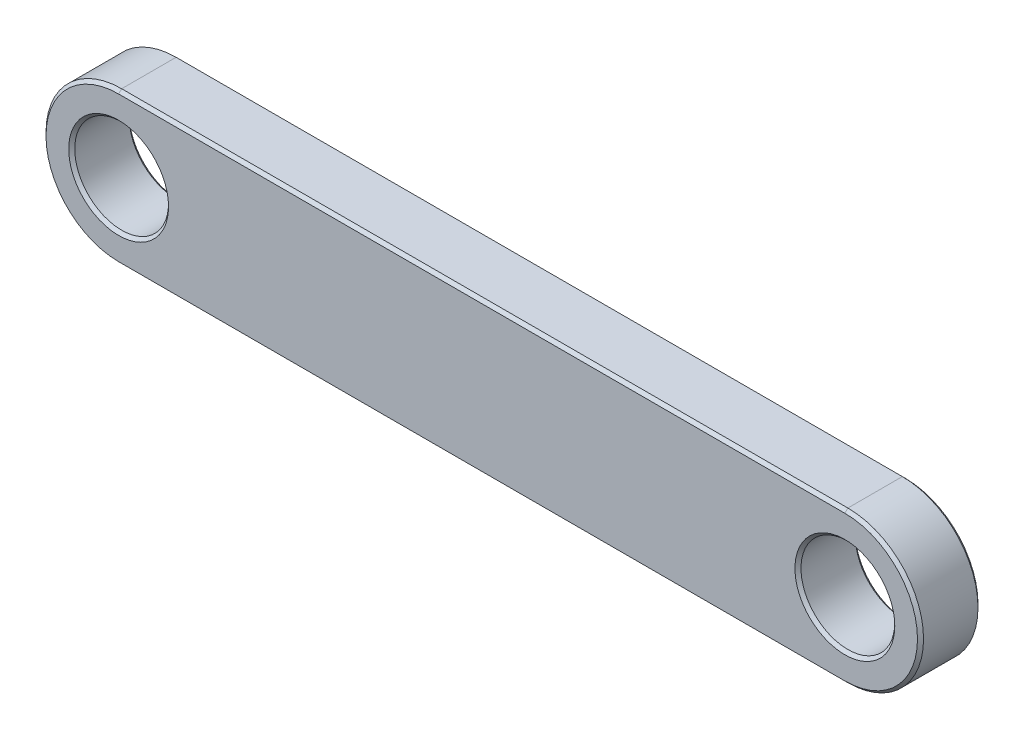
ISO-10303-21;
HEADER;
FILE_DESCRIPTION(('STEP AP214'),'2;1');
FILE_NAME('part.step','',(''),(''),'','','');
FILE_SCHEMA(('AUTOMOTIVE_DESIGN { 1 0 10303 214 1 1 1 1 }'));
ENDSEC;
DATA;
#1=APPLICATION_CONTEXT('core data for automotive mechanical design processes');
#2=APPLICATION_PROTOCOL_DEFINITION('international standard','automotive_design',2000,#1);
#3=PRODUCT_CONTEXT('',#1,'mechanical');
#4=PRODUCT('Part','Part','',(#3));
#5=PRODUCT_RELATED_PRODUCT_CATEGORY('part','',(#4));
#6=PRODUCT_DEFINITION_FORMATION('','',#4);
#7=PRODUCT_DEFINITION_CONTEXT('part definition',#1,'design');
#8=PRODUCT_DEFINITION('design','',#6,#7);
#9=PRODUCT_DEFINITION_SHAPE('','',#8);
#10=(LENGTH_UNIT() NAMED_UNIT(*) SI_UNIT(.MILLI.,.METRE.));
#11=(NAMED_UNIT(*) PLANE_ANGLE_UNIT() SI_UNIT($,.RADIAN.));
#12=(NAMED_UNIT(*) SI_UNIT($,.STERADIAN.) SOLID_ANGLE_UNIT());
#13=UNCERTAINTY_MEASURE_WITH_UNIT(LENGTH_MEASURE(1.E-05),#10,'distance_accuracy_value','');
#14=(GEOMETRIC_REPRESENTATION_CONTEXT(3) GLOBAL_UNCERTAINTY_ASSIGNED_CONTEXT((#13)) GLOBAL_UNIT_ASSIGNED_CONTEXT((#10,
#11,#12)) REPRESENTATION_CONTEXT('',''));
#15=CARTESIAN_POINT('',(0.,0.,0.));
#16=DIRECTION('',(0.,0.,1.));
#17=DIRECTION('',(1.,0.,0.));
#18=AXIS2_PLACEMENT_3D('',#15,#16,#17);
#19=CARTESIAN_POINT('',(-12.,0.,2.));
#20=DIRECTION('',(0.,0.,-1.));
#21=DIRECTION('',(-1.,0.,0.));
#22=AXIS2_PLACEMENT_3D('',#19,#20,#21);
#23=CYLINDRICAL_SURFACE('',#22,2.5);
#24=DIRECTION('',(0.,0.,-1.));
#25=VECTOR('',#24,1.);
#26=CARTESIAN_POINT('',(-12.,-2.5,2.));
#27=LINE('',#26,#25);
#28=CARTESIAN_POINT('',(-12.,-2.5,1.9));
#29=VERTEX_POINT('',#28);
#30=CARTESIAN_POINT('',(-12.,-2.5,0.0999999999999959));
#31=VERTEX_POINT('',#30);
#32=EDGE_CURVE('E241',#29,#31,#27,.T.);
#33=ORIENTED_EDGE('',*,*,#32,.F.);
#34=CARTESIAN_POINT('',(-12.,0.,1.9));
#35=DIRECTION('',(0.,0.,1.));
#36=DIRECTION('',(1.,0.,0.));
#37=AXIS2_PLACEMENT_3D('',#34,#35,#36);
#38=CIRCLE('',#37,2.5);
#39=CARTESIAN_POINT('',(-12.,2.5,1.9));
#40=VERTEX_POINT('',#39);
#41=EDGE_CURVE('E212',#29,#40,#38,.F.);
#42=ORIENTED_EDGE('',*,*,#41,.T.);
#43=DIRECTION('',(0.,0.,-1.));
#44=VECTOR('',#43,1.);
#45=CARTESIAN_POINT('',(-12.,2.5,2.));
#46=LINE('',#45,#44);
#47=CARTESIAN_POINT('',(-12.,2.5,0.0999999999999959));
#48=VERTEX_POINT('',#47);
#49=EDGE_CURVE('E150',#40,#48,#46,.T.);
#50=ORIENTED_EDGE('',*,*,#49,.T.);
#51=CARTESIAN_POINT('',(-12.,0.,0.0999999999999959));
#52=DIRECTION('',(0.,0.,1.));
#53=DIRECTION('',(1.,0.,0.));
#54=AXIS2_PLACEMENT_3D('',#51,#52,#53);
#55=CIRCLE('',#54,2.5);
#56=EDGE_CURVE('E215',#48,#31,#55,.T.);
#57=ORIENTED_EDGE('',*,*,#56,.T.);
#58=EDGE_LOOP('',(#33,#42,#50,#57));
#59=FACE_BOUND('',#58,.T.);
#60=ADVANCED_FACE('F46',(#59),#23,.T.);
#61=CARTESIAN_POINT('',(-12.,-2.5,2.));
#62=DIRECTION('',(0.,1.,0.));
#63=DIRECTION('',(-1.,0.,0.));
#64=AXIS2_PLACEMENT_3D('',#61,#62,#63);
#65=PLANE('',#64);
#66=DIRECTION('',(0.,0.,-1.));
#67=VECTOR('',#66,1.);
#68=CARTESIAN_POINT('',(12.,-2.5,2.));
#69=LINE('',#68,#67);
#70=CARTESIAN_POINT('',(12.,-2.5,1.9));
#71=VERTEX_POINT('',#70);
#72=CARTESIAN_POINT('',(12.,-2.5,0.0999999999999959));
#73=VERTEX_POINT('',#72);
#74=EDGE_CURVE('E245',#71,#73,#69,.T.);
#75=ORIENTED_EDGE('',*,*,#74,.F.);
#76=DIRECTION('',(-1.,0.,0.));
#77=VECTOR('',#76,1.);
#78=CARTESIAN_POINT('',(-12.,-2.5,1.9));
#79=LINE('',#78,#77);
#80=EDGE_CURVE('E223',#71,#29,#79,.T.);
#81=ORIENTED_EDGE('',*,*,#80,.T.);
#82=ORIENTED_EDGE('',*,*,#32,.T.);
#83=DIRECTION('',(1.,0.,0.));
#84=VECTOR('',#83,1.);
#85=CARTESIAN_POINT('',(-12.,-2.5,0.0999999999999959));
#86=LINE('',#85,#84);
#87=EDGE_CURVE('E227',#31,#73,#86,.T.);
#88=ORIENTED_EDGE('',*,*,#87,.T.);
#89=EDGE_LOOP('',(#75,#81,#82,#88));
#90=FACE_BOUND('',#89,.T.);
#91=ADVANCED_FACE('F280',(#90),#65,.F.);
#92=CARTESIAN_POINT('',(12.,0.,2.));
#93=DIRECTION('',(0.,0.,-1.));
#94=DIRECTION('',(-1.,0.,0.));
#95=AXIS2_PLACEMENT_3D('',#92,#93,#94);
#96=CYLINDRICAL_SURFACE('',#95,2.5);
#97=DIRECTION('',(0.,0.,-1.));
#98=VECTOR('',#97,1.);
#99=CARTESIAN_POINT('',(12.,2.50000000000001,2.));
#100=LINE('',#99,#98);
#101=CARTESIAN_POINT('',(12.,2.50000000000001,1.9));
#102=VERTEX_POINT('',#101);
#103=CARTESIAN_POINT('',(12.,2.50000000000001,0.0999999999999959));
#104=VERTEX_POINT('',#103);
#105=EDGE_CURVE('E249',#102,#104,#100,.T.);
#106=ORIENTED_EDGE('',*,*,#105,.F.);
#107=CARTESIAN_POINT('',(12.,0.,1.9));
#108=DIRECTION('',(0.,0.,1.));
#109=DIRECTION('',(1.,0.,0.));
#110=AXIS2_PLACEMENT_3D('',#107,#108,#109);
#111=CIRCLE('',#110,2.5);
#112=EDGE_CURVE('E144',#102,#71,#111,.F.);
#113=ORIENTED_EDGE('',*,*,#112,.T.);
#114=ORIENTED_EDGE('',*,*,#74,.T.);
#115=CARTESIAN_POINT('',(12.,0.,0.0999999999999959));
#116=DIRECTION('',(0.,0.,1.));
#117=DIRECTION('',(1.,0.,0.));
#118=AXIS2_PLACEMENT_3D('',#115,#116,#117);
#119=CIRCLE('',#118,2.5);
#120=EDGE_CURVE('E220',#73,#104,#119,.T.);
#121=ORIENTED_EDGE('',*,*,#120,.T.);
#122=EDGE_LOOP('',(#106,#113,#114,#121));
#123=FACE_BOUND('',#122,.T.);
#124=ADVANCED_FACE('F284',(#123),#96,.T.);
#125=CARTESIAN_POINT('',(-12.,2.5,2.));
#126=DIRECTION('',(0.,-1.,0.));
#127=DIRECTION('',(1.,0.,0.));
#128=AXIS2_PLACEMENT_3D('',#125,#126,#127);
#129=PLANE('',#128);
#130=ORIENTED_EDGE('',*,*,#49,.F.);
#131=DIRECTION('',(1.,0.,0.));
#132=VECTOR('',#131,1.);
#133=CARTESIAN_POINT('',(12.,2.50000000000001,1.9));
#134=LINE('',#133,#132);
#135=EDGE_CURVE('E205',#40,#102,#134,.T.);
#136=ORIENTED_EDGE('',*,*,#135,.T.);
#137=ORIENTED_EDGE('',*,*,#105,.T.);
#138=DIRECTION('',(-1.,0.,0.));
#139=VECTOR('',#138,1.);
#140=CARTESIAN_POINT('',(-12.,2.5,0.0999999999999959));
#141=LINE('',#140,#139);
#142=EDGE_CURVE('E208',#104,#48,#141,.T.);
#143=ORIENTED_EDGE('',*,*,#142,.T.);
#144=EDGE_LOOP('',(#130,#136,#137,#143));
#145=FACE_BOUND('',#144,.T.);
#146=ADVANCED_FACE('F260',(#145),#129,.F.);
#147=CARTESIAN_POINT('',(-12.,0.,2.));
#148=DIRECTION('',(0.,0.,1.));
#149=DIRECTION('',(1.,0.,0.));
#150=AXIS2_PLACEMENT_3D('',#147,#148,#149);
#151=PLANE('',#150);
#152=CARTESIAN_POINT('',(-12.,0.,2.));
#153=DIRECTION('',(0.,0.,1.));
#154=DIRECTION('',(1.,0.,0.));
#155=AXIS2_PLACEMENT_3D('',#152,#153,#154);
#156=CIRCLE('',#155,2.4);
#157=CARTESIAN_POINT('',(-12.,2.4,2.));
#158=VERTEX_POINT('',#157);
#159=CARTESIAN_POINT('',(-12.,-2.4,2.));
#160=VERTEX_POINT('',#159);
#161=EDGE_CURVE('E129',#158,#160,#156,.T.);
#162=ORIENTED_EDGE('',*,*,#161,.T.);
#163=DIRECTION('',(1.,0.,0.));
#164=VECTOR('',#163,1.);
#165=CARTESIAN_POINT('',(12.,-2.4,2.));
#166=LINE('',#165,#164);
#167=CARTESIAN_POINT('',(12.,-2.4,2.));
#168=VERTEX_POINT('',#167);
#169=EDGE_CURVE('E124',#160,#168,#166,.T.);
#170=ORIENTED_EDGE('',*,*,#169,.T.);
#171=CARTESIAN_POINT('',(12.,0.,2.));
#172=DIRECTION('',(0.,0.,1.));
#173=DIRECTION('',(1.,0.,0.));
#174=AXIS2_PLACEMENT_3D('',#171,#172,#173);
#175=CIRCLE('',#174,2.4);
#176=CARTESIAN_POINT('',(12.,2.40000000000001,2.));
#177=VERTEX_POINT('',#176);
#178=EDGE_CURVE('E117',#168,#177,#175,.T.);
#179=ORIENTED_EDGE('',*,*,#178,.T.);
#180=DIRECTION('',(-1.,0.,0.));
#181=VECTOR('',#180,1.);
#182=CARTESIAN_POINT('',(-12.,2.4,2.));
#183=LINE('',#182,#181);
#184=EDGE_CURVE('E121',#177,#158,#183,.T.);
#185=ORIENTED_EDGE('',*,*,#184,.T.);
#186=EDGE_LOOP('',(#162,#170,#179,#185));
#187=FACE_BOUND('',#186,.T.);
#188=CARTESIAN_POINT('',(12.,0.,2.));
#189=DIRECTION('',(0.,0.,1.));
#190=DIRECTION('',(1.,0.,0.));
#191=AXIS2_PLACEMENT_3D('',#188,#189,#190);
#192=CIRCLE('',#191,1.65000000000001);
#193=CARTESIAN_POINT('',(13.65,0.,2.));
#194=VERTEX_POINT('',#193);
#195=EDGE_CURVE('E141',#194,#194,#192,.F.);
#196=ORIENTED_EDGE('',*,*,#195,.T.);
#197=EDGE_LOOP('',(#196));
#198=FACE_BOUND('',#197,.T.);
#199=CARTESIAN_POINT('',(-12.,0.,2.));
#200=DIRECTION('',(0.,0.,1.));
#201=DIRECTION('',(1.,0.,0.));
#202=AXIS2_PLACEMENT_3D('',#199,#200,#201);
#203=CIRCLE('',#202,1.65000000000001);
#204=CARTESIAN_POINT('',(-10.35,0.,2.));
#205=VERTEX_POINT('',#204);
#206=EDGE_CURVE('E237',#205,#205,#203,.F.);
#207=ORIENTED_EDGE('',*,*,#206,.T.);
#208=EDGE_LOOP('',(#207));
#209=FACE_BOUND('',#208,.T.);
#210=ADVANCED_FACE('F119',(#187,#198,#209),#151,.T.);
#211=CARTESIAN_POINT('',(-12.,0.,0.));
#212=DIRECTION('',(0.,0.,1.));
#213=DIRECTION('',(1.,0.,0.));
#214=AXIS2_PLACEMENT_3D('',#211,#212,#213);
#215=PLANE('',#214);
#216=CARTESIAN_POINT('',(-12.,0.,0.));
#217=DIRECTION('',(0.,0.,1.));
#218=DIRECTION('',(1.,0.,0.));
#219=AXIS2_PLACEMENT_3D('',#216,#217,#218);
#220=CIRCLE('',#219,2.4);
#221=CARTESIAN_POINT('',(-12.,-2.4,0.));
#222=VERTEX_POINT('',#221);
#223=CARTESIAN_POINT('',(-12.,2.4,0.));
#224=VERTEX_POINT('',#223);
#225=EDGE_CURVE('E65',#222,#224,#220,.F.);
#226=ORIENTED_EDGE('',*,*,#225,.T.);
#227=DIRECTION('',(1.,0.,0.));
#228=VECTOR('',#227,1.);
#229=CARTESIAN_POINT('',(-12.,2.4,0.));
#230=LINE('',#229,#228);
#231=CARTESIAN_POINT('',(12.,2.4,0.));
#232=VERTEX_POINT('',#231);
#233=EDGE_CURVE('E186',#224,#232,#230,.T.);
#234=ORIENTED_EDGE('',*,*,#233,.T.);
#235=CARTESIAN_POINT('',(12.,0.,0.));
#236=DIRECTION('',(0.,0.,1.));
#237=DIRECTION('',(1.,0.,0.));
#238=AXIS2_PLACEMENT_3D('',#235,#236,#237);
#239=CIRCLE('',#238,2.4);
#240=CARTESIAN_POINT('',(12.,-2.4,0.));
#241=VERTEX_POINT('',#240);
#242=EDGE_CURVE('E191',#232,#241,#239,.F.);
#243=ORIENTED_EDGE('',*,*,#242,.T.);
#244=DIRECTION('',(-1.,0.,0.));
#245=VECTOR('',#244,1.);
#246=CARTESIAN_POINT('',(-12.,-2.4,0.));
#247=LINE('',#246,#245);
#248=EDGE_CURVE('E194',#241,#222,#247,.T.);
#249=ORIENTED_EDGE('',*,*,#248,.T.);
#250=EDGE_LOOP('',(#226,#234,#243,#249));
#251=FACE_BOUND('',#250,.T.);
#252=CARTESIAN_POINT('',(12.,0.,0.));
#253=DIRECTION('',(0.,0.,1.));
#254=DIRECTION('',(1.,0.,0.));
#255=AXIS2_PLACEMENT_3D('',#252,#253,#254);
#256=CIRCLE('',#255,1.65000000000001);
#257=CARTESIAN_POINT('',(13.65,0.,0.));
#258=VERTEX_POINT('',#257);
#259=EDGE_CURVE('E197',#258,#258,#256,.T.);
#260=ORIENTED_EDGE('',*,*,#259,.T.);
#261=EDGE_LOOP('',(#260));
#262=FACE_BOUND('',#261,.T.);
#263=CARTESIAN_POINT('',(-12.,0.,0.));
#264=DIRECTION('',(0.,0.,1.));
#265=DIRECTION('',(1.,0.,0.));
#266=AXIS2_PLACEMENT_3D('',#263,#264,#265);
#267=CIRCLE('',#266,1.65);
#268=CARTESIAN_POINT('',(-10.35,0.,0.));
#269=VERTEX_POINT('',#268);
#270=EDGE_CURVE('E201',#269,#269,#267,.T.);
#271=ORIENTED_EDGE('',*,*,#270,.T.);
#272=EDGE_LOOP('',(#271));
#273=FACE_BOUND('',#272,.T.);
#274=ADVANCED_FACE('F293',(#251,#262,#273),#215,.F.);
#275=CARTESIAN_POINT('',(12.,0.,0.));
#276=DIRECTION('',(0.,0.,1.));
#277=DIRECTION('',(1.,0.,0.));
#278=AXIS2_PLACEMENT_3D('',#275,#276,#277);
#279=CYLINDRICAL_SURFACE('',#278,1.55);
#280=CARTESIAN_POINT('',(12.,0.,0.100000000000005));
#281=DIRECTION('',(0.,0.,1.));
#282=DIRECTION('',(1.,0.,0.));
#283=AXIS2_PLACEMENT_3D('',#280,#281,#282);
#284=CIRCLE('',#283,1.55);
#285=CARTESIAN_POINT('',(13.55,0.,0.100000000000005));
#286=VERTEX_POINT('',#285);
#287=EDGE_CURVE('E178',#286,#286,#284,.F.);
#288=ORIENTED_EDGE('',*,*,#287,.T.);
#289=EDGE_LOOP('',(#288));
#290=FACE_BOUND('',#289,.T.);
#291=CARTESIAN_POINT('',(12.,0.,1.89999999999999));
#292=DIRECTION('',(0.,0.,1.));
#293=DIRECTION('',(1.,0.,0.));
#294=AXIS2_PLACEMENT_3D('',#291,#292,#293);
#295=CIRCLE('',#294,1.55);
#296=CARTESIAN_POINT('',(13.55,0.,1.89999999999999));
#297=VERTEX_POINT('',#296);
#298=EDGE_CURVE('E182',#297,#297,#295,.T.);
#299=ORIENTED_EDGE('',*,*,#298,.T.);
#300=EDGE_LOOP('',(#299));
#301=FACE_BOUND('',#300,.T.);
#302=ADVANCED_FACE('F296',(#290,#301),#279,.F.);
#303=CARTESIAN_POINT('',(-12.,0.,0.));
#304=DIRECTION('',(0.,0.,1.));
#305=DIRECTION('',(1.,0.,0.));
#306=AXIS2_PLACEMENT_3D('',#303,#304,#305);
#307=CYLINDRICAL_SURFACE('',#306,1.55);
#308=CARTESIAN_POINT('',(-12.,0.,0.100000000000001));
#309=DIRECTION('',(0.,0.,1.));
#310=DIRECTION('',(1.,0.,0.));
#311=AXIS2_PLACEMENT_3D('',#308,#309,#310);
#312=CIRCLE('',#311,1.55);
#313=CARTESIAN_POINT('',(-10.45,0.,0.100000000000001));
#314=VERTEX_POINT('',#313);
#315=EDGE_CURVE('E11',#314,#314,#312,.F.);
#316=ORIENTED_EDGE('',*,*,#315,.T.);
#317=EDGE_LOOP('',(#316));
#318=FACE_BOUND('',#317,.T.);
#319=CARTESIAN_POINT('',(-12.,0.,1.89999999999999));
#320=DIRECTION('',(0.,0.,1.));
#321=DIRECTION('',(1.,0.,0.));
#322=AXIS2_PLACEMENT_3D('',#319,#320,#321);
#323=CIRCLE('',#322,1.55);
#324=CARTESIAN_POINT('',(-10.45,0.,1.89999999999999));
#325=VERTEX_POINT('',#324);
#326=EDGE_CURVE('E57',#325,#325,#323,.T.);
#327=ORIENTED_EDGE('',*,*,#326,.T.);
#328=EDGE_LOOP('',(#327));
#329=FACE_BOUND('',#328,.T.);
#330=ADVANCED_FACE('F301',(#318,#329),#307,.F.);
#331=CARTESIAN_POINT('',(-12.,2.4,2.));
#332=DIRECTION('',(0.,0.70710678118656,0.707106781186535));
#333=DIRECTION('',(1.,0.,0.));
#334=AXIS2_PLACEMENT_3D('',#331,#332,#333);
#335=PLANE('',#334);
#336=DIRECTION('',(0.,-0.707106781186535,0.70710678118656));
#337=VECTOR('',#336,1.);
#338=CARTESIAN_POINT('',(12.,2.50000000000001,1.9));
#339=LINE('',#338,#337);
#340=EDGE_CURVE('E135',#102,#177,#339,.T.);
#341=ORIENTED_EDGE('',*,*,#340,.F.);
#342=ORIENTED_EDGE('',*,*,#135,.F.);
#343=DIRECTION('',(0.,0.707106781186535,-0.70710678118656));
#344=VECTOR('',#343,1.);
#345=CARTESIAN_POINT('',(-12.,2.4,2.));
#346=LINE('',#345,#344);
#347=EDGE_CURVE('E138',#158,#40,#346,.T.);
#348=ORIENTED_EDGE('',*,*,#347,.F.);
#349=ORIENTED_EDGE('',*,*,#184,.F.);
#350=EDGE_LOOP('',(#341,#342,#348,#349));
#351=FACE_BOUND('',#350,.T.);
#352=ADVANCED_FACE('F133',(#351),#335,.T.);
#353=CARTESIAN_POINT('',(-12.,0.,2.));
#354=DIRECTION('',(0.,0.,-1.));
#355=DIRECTION('',(-1.,0.,0.));
#356=AXIS2_PLACEMENT_3D('',#353,#354,#355);
#357=CONICAL_SURFACE('',#356,2.4,0.785398163397431);
#358=ORIENTED_EDGE('',*,*,#347,.T.);
#359=ORIENTED_EDGE('',*,*,#41,.F.);
#360=DIRECTION('',(0.,-0.707106781186535,-0.70710678118656));
#361=VECTOR('',#360,1.);
#362=CARTESIAN_POINT('',(-12.,-2.4,2.));
#363=LINE('',#362,#361);
#364=EDGE_CURVE('E146',#160,#29,#363,.T.);
#365=ORIENTED_EDGE('',*,*,#364,.F.);
#366=ORIENTED_EDGE('',*,*,#161,.F.);
#367=EDGE_LOOP('',(#358,#359,#365,#366));
#368=FACE_BOUND('',#367,.T.);
#369=ADVANCED_FACE('F263',(#368),#357,.T.);
#370=CARTESIAN_POINT('',(12.,0.,2.));
#371=DIRECTION('',(0.,0.,-1.));
#372=DIRECTION('',(-1.,0.,0.));
#373=AXIS2_PLACEMENT_3D('',#370,#371,#372);
#374=CONICAL_SURFACE('',#373,2.4,0.785398163397431);
#375=ORIENTED_EDGE('',*,*,#340,.T.);
#376=ORIENTED_EDGE('',*,*,#178,.F.);
#377=DIRECTION('',(0.,0.707106781186535,0.70710678118656));
#378=VECTOR('',#377,1.);
#379=CARTESIAN_POINT('',(12.,-2.5,1.9));
#380=LINE('',#379,#378);
#381=EDGE_CURVE('E152',#71,#168,#380,.T.);
#382=ORIENTED_EDGE('',*,*,#381,.F.);
#383=ORIENTED_EDGE('',*,*,#112,.F.);
#384=EDGE_LOOP('',(#375,#376,#382,#383));
#385=FACE_BOUND('',#384,.T.);
#386=ADVANCED_FACE('F143',(#385),#374,.T.);
#387=CARTESIAN_POINT('',(-12.,-2.4,2.));
#388=DIRECTION('',(0.,-0.70710678118656,0.707106781186535));
#389=DIRECTION('',(-1.,0.,0.));
#390=AXIS2_PLACEMENT_3D('',#387,#388,#389);
#391=PLANE('',#390);
#392=ORIENTED_EDGE('',*,*,#364,.T.);
#393=ORIENTED_EDGE('',*,*,#80,.F.);
#394=ORIENTED_EDGE('',*,*,#381,.T.);
#395=ORIENTED_EDGE('',*,*,#169,.F.);
#396=EDGE_LOOP('',(#392,#393,#394,#395));
#397=FACE_BOUND('',#396,.T.);
#398=ADVANCED_FACE('F265',(#397),#391,.T.);
#399=CARTESIAN_POINT('',(-12.,-2.5,0.0999999999999959));
#400=DIRECTION('',(0.,0.707106781186535,0.70710678118656));
#401=DIRECTION('',(1.,0.,0.));
#402=AXIS2_PLACEMENT_3D('',#399,#400,#401);
#403=PLANE('',#402);
#404=DIRECTION('',(0.,-0.70710678118656,0.707106781186535));
#405=VECTOR('',#404,1.);
#406=CARTESIAN_POINT('',(-12.,-2.4,0.));
#407=LINE('',#406,#405);
#408=EDGE_CURVE('E160',#222,#31,#407,.T.);
#409=ORIENTED_EDGE('',*,*,#408,.F.);
#410=ORIENTED_EDGE('',*,*,#248,.F.);
#411=DIRECTION('',(0.,0.70710678118656,-0.707106781186535));
#412=VECTOR('',#411,1.);
#413=CARTESIAN_POINT('',(12.,-2.5,0.0999999999999959));
#414=LINE('',#413,#412);
#415=EDGE_CURVE('E51',#73,#241,#414,.T.);
#416=ORIENTED_EDGE('',*,*,#415,.F.);
#417=ORIENTED_EDGE('',*,*,#87,.F.);
#418=EDGE_LOOP('',(#409,#410,#416,#417));
#419=FACE_BOUND('',#418,.T.);
#420=ADVANCED_FACE('F267',(#419),#403,.F.);
#421=CARTESIAN_POINT('',(12.,0.,0.0999999999999959));
#422=DIRECTION('',(0.,0.,1.));
#423=DIRECTION('',(1.,0.,0.));
#424=AXIS2_PLACEMENT_3D('',#421,#422,#423);
#425=CONICAL_SURFACE('',#424,2.5,0.785398163397466);
#426=ORIENTED_EDGE('',*,*,#415,.T.);
#427=ORIENTED_EDGE('',*,*,#242,.F.);
#428=DIRECTION('',(0.,-0.70710678118656,-0.707106781186535));
#429=VECTOR('',#428,1.);
#430=CARTESIAN_POINT('',(12.,2.5,0.0999999999999959));
#431=LINE('',#430,#429);
#432=EDGE_CURVE('E72',#104,#232,#431,.T.);
#433=ORIENTED_EDGE('',*,*,#432,.F.);
#434=ORIENTED_EDGE('',*,*,#120,.F.);
#435=EDGE_LOOP('',(#426,#427,#433,#434));
#436=FACE_BOUND('',#435,.T.);
#437=ADVANCED_FACE('F273',(#436),#425,.T.);
#438=CARTESIAN_POINT('',(-12.,0.,0.0999999999999959));
#439=DIRECTION('',(0.,0.,1.));
#440=DIRECTION('',(1.,0.,0.));
#441=AXIS2_PLACEMENT_3D('',#438,#439,#440);
#442=CONICAL_SURFACE('',#441,2.5,0.785398163397466);
#443=ORIENTED_EDGE('',*,*,#408,.T.);
#444=ORIENTED_EDGE('',*,*,#56,.F.);
#445=DIRECTION('',(0.,0.70710678118656,0.707106781186535));
#446=VECTOR('',#445,1.);
#447=CARTESIAN_POINT('',(-12.,2.4,0.));
#448=LINE('',#447,#446);
#449=EDGE_CURVE('E156',#224,#48,#448,.T.);
#450=ORIENTED_EDGE('',*,*,#449,.F.);
#451=ORIENTED_EDGE('',*,*,#225,.F.);
#452=EDGE_LOOP('',(#443,#444,#450,#451));
#453=FACE_BOUND('',#452,.T.);
#454=ADVANCED_FACE('F354',(#453),#442,.T.);
#455=CARTESIAN_POINT('',(-12.,2.5,0.0999999999999959));
#456=DIRECTION('',(0.,-0.707106781186535,0.70710678118656));
#457=DIRECTION('',(-1.,0.,0.));
#458=AXIS2_PLACEMENT_3D('',#455,#456,#457);
#459=PLANE('',#458);
#460=ORIENTED_EDGE('',*,*,#432,.T.);
#461=ORIENTED_EDGE('',*,*,#233,.F.);
#462=ORIENTED_EDGE('',*,*,#449,.T.);
#463=ORIENTED_EDGE('',*,*,#142,.F.);
#464=EDGE_LOOP('',(#460,#461,#462,#463));
#465=FACE_BOUND('',#464,.T.);
#466=ADVANCED_FACE('F342',(#465),#459,.F.);
#467=CARTESIAN_POINT('',(12.,0.,0.));
#468=DIRECTION('',(0.,0.,-1.));
#469=DIRECTION('',(-1.,0.,0.));
#470=AXIS2_PLACEMENT_3D('',#467,#468,#469);
#471=CONICAL_SURFACE('',#470,1.65000000000001,0.785398163397456);
#472=ORIENTED_EDGE('',*,*,#287,.F.);
#473=EDGE_LOOP('',(#472));
#474=FACE_BOUND('',#473,.T.);
#475=ORIENTED_EDGE('',*,*,#259,.F.);
#476=EDGE_LOOP('',(#475));
#477=FACE_BOUND('',#476,.T.);
#478=ADVANCED_FACE('F326',(#474,#477),#471,.F.);
#479=CARTESIAN_POINT('',(12.,0.,1.89999999999999));
#480=DIRECTION('',(0.,0.,1.));
#481=DIRECTION('',(1.,0.,0.));
#482=AXIS2_PLACEMENT_3D('',#479,#480,#481);
#483=CONICAL_SURFACE('',#482,1.55,0.785398163397442);
#484=ORIENTED_EDGE('',*,*,#195,.F.);
#485=EDGE_LOOP('',(#484));
#486=FACE_BOUND('',#485,.T.);
#487=ORIENTED_EDGE('',*,*,#298,.F.);
#488=EDGE_LOOP('',(#487));
#489=FACE_BOUND('',#488,.T.);
#490=ADVANCED_FACE('F319',(#486,#489),#483,.F.);
#491=CARTESIAN_POINT('',(-12.,0.,0.));
#492=DIRECTION('',(0.,0.,-1.));
#493=DIRECTION('',(-1.,0.,0.));
#494=AXIS2_PLACEMENT_3D('',#491,#492,#493);
#495=CONICAL_SURFACE('',#494,1.65,0.785398163397439);
#496=ORIENTED_EDGE('',*,*,#315,.F.);
#497=EDGE_LOOP('',(#496));
#498=FACE_BOUND('',#497,.T.);
#499=ORIENTED_EDGE('',*,*,#270,.F.);
#500=EDGE_LOOP('',(#499));
#501=FACE_BOUND('',#500,.T.);
#502=ADVANCED_FACE('F314',(#498,#501),#495,.F.);
#503=CARTESIAN_POINT('',(-12.,0.,1.89999999999999));
#504=DIRECTION('',(0.,0.,1.));
#505=DIRECTION('',(1.,0.,0.));
#506=AXIS2_PLACEMENT_3D('',#503,#504,#505);
#507=CONICAL_SURFACE('',#506,1.55,0.785398163397442);
#508=ORIENTED_EDGE('',*,*,#206,.F.);
#509=EDGE_LOOP('',(#508));
#510=FACE_BOUND('',#509,.T.);
#511=ORIENTED_EDGE('',*,*,#326,.F.);
#512=EDGE_LOOP('',(#511));
#513=FACE_BOUND('',#512,.T.);
#514=ADVANCED_FACE('F49',(#510,#513),#507,.F.);
#515=CLOSED_SHELL('',(#60,#91,#124,#146,#210,#274,#302,#330,#352,#369,#386,#398,#420,#437,#454,
#466,#478,#490,#502,#514));
#516=MANIFOLD_SOLID_BREP('B2',#515);
#517=ADVANCED_BREP_SHAPE_REPRESENTATION('',(#18,#516),#14);
#518=SHAPE_DEFINITION_REPRESENTATION(#9,#517);
ENDSEC;
END-ISO-10303-21;
